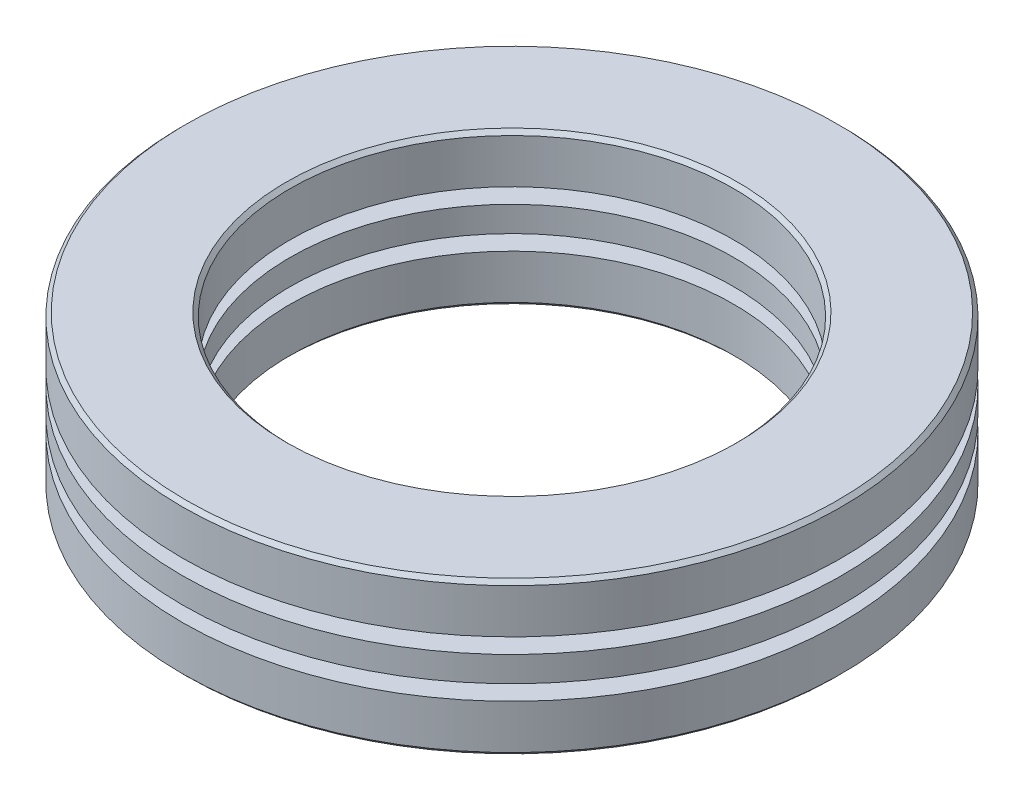
ISO-10303-21;
HEADER;
FILE_DESCRIPTION(('STEP AP214'),'2;1');
FILE_NAME('part.step','',(''),(''),'','','');
FILE_SCHEMA(('AUTOMOTIVE_DESIGN { 1 0 10303 214 1 1 1 1 }'));
ENDSEC;
DATA;
#1=APPLICATION_CONTEXT('core data for automotive mechanical design processes');
#2=APPLICATION_PROTOCOL_DEFINITION('international standard','automotive_design',2000,#1);
#3=PRODUCT_CONTEXT('',#1,'mechanical');
#4=PRODUCT('Part','Part','',(#3));
#5=PRODUCT_RELATED_PRODUCT_CATEGORY('part','',(#4));
#6=PRODUCT_DEFINITION_FORMATION('','',#4);
#7=PRODUCT_DEFINITION_CONTEXT('part definition',#1,'design');
#8=PRODUCT_DEFINITION('design','',#6,#7);
#9=PRODUCT_DEFINITION_SHAPE('','',#8);
#10=(LENGTH_UNIT() NAMED_UNIT(*) SI_UNIT(.MILLI.,.METRE.));
#11=(NAMED_UNIT(*) PLANE_ANGLE_UNIT() SI_UNIT($,.RADIAN.));
#12=(NAMED_UNIT(*) SI_UNIT($,.STERADIAN.) SOLID_ANGLE_UNIT());
#13=UNCERTAINTY_MEASURE_WITH_UNIT(LENGTH_MEASURE(1.E-05),#10,'distance_accuracy_value','');
#14=(GEOMETRIC_REPRESENTATION_CONTEXT(3) GLOBAL_UNCERTAINTY_ASSIGNED_CONTEXT((#13)) GLOBAL_UNIT_ASSIGNED_CONTEXT((#10,
#11,#12)) REPRESENTATION_CONTEXT('',''));
#15=CARTESIAN_POINT('',(0.,0.,0.));
#16=DIRECTION('',(0.,0.,1.));
#17=DIRECTION('',(1.,0.,0.));
#18=AXIS2_PLACEMENT_3D('',#15,#16,#17);
#19=CARTESIAN_POINT('',(-20.0943798321206,6.,8.32336465394043));
#20=DIRECTION('',(-0.923879532511292,0.,0.382683432365077));
#21=DIRECTION('',(0.,1.,0.));
#22=AXIS2_PLACEMENT_3D('',#19,#20,#21);
#23=SPHERICAL_SURFACE('',#22,2.2);
#24=CARTESIAN_POINT('',(-22.1269148036454,6.,9.1652682051436));
#25=VERTEX_POINT('',#24);
#26=VERTEX_LOOP('',#25);
#27=FACE_BOUND('',#26,.T.);
#28=ADVANCED_FACE('F37',(#27),#23,.T.);
#29=CLOSED_SHELL('',(#28));
#30=MANIFOLD_SOLID_BREP('B2',#29);
#31=CARTESIAN_POINT('',(-15.3795724908076,6.,15.3795724908072));
#32=DIRECTION('',(-0.707106781186556,0.,0.707106781186539));
#33=DIRECTION('',(0.,1.,0.));
#34=AXIS2_PLACEMENT_3D('',#31,#32,#33);
#35=SPHERICAL_SURFACE('',#34,2.2);
#36=CARTESIAN_POINT('',(-16.935207409418,6.,16.9352074094176));
#37=VERTEX_POINT('',#36);
#38=VERTEX_LOOP('',#37);
#39=FACE_BOUND('',#38,.T.);
#40=ADVANCED_FACE('F55',(#39),#35,.T.);
#41=CLOSED_SHELL('',(#40));
#42=MANIFOLD_SOLID_BREP('B6',#41);
#43=CARTESIAN_POINT('',(-8.32336465394092,6.,20.0943798321204));
#44=DIRECTION('',(-0.3826834323651,0.,0.923879532511283));
#45=DIRECTION('',(0.,1.,0.));
#46=AXIS2_PLACEMENT_3D('',#43,#44,#45);
#47=SPHERICAL_SURFACE('',#46,2.2);
#48=CARTESIAN_POINT('',(-9.16526820514414,6.,22.1269148036452));
#49=VERTEX_POINT('',#48);
#50=VERTEX_LOOP('',#49);
#51=FACE_BOUND('',#50,.T.);
#52=ADVANCED_FACE('F73',(#51),#47,.T.);
#53=CLOSED_SHELL('',(#52));
#54=MANIFOLD_SOLID_BREP('B33',#53);
#55=CARTESIAN_POINT('',(-2.27819157359514E-13,6.,21.75));
#56=DIRECTION('',(0.,0.,1.));
#57=DIRECTION('',(0.,1.,0.));
#58=AXIS2_PLACEMENT_3D('',#55,#56,#57);
#59=SPHERICAL_SURFACE('',#58,2.2);
#60=CARTESIAN_POINT('',(-2.50862934195879E-13,6.,23.95));
#61=VERTEX_POINT('',#60);
#62=VERTEX_LOOP('',#61);
#63=FACE_BOUND('',#62,.T.);
#64=ADVANCED_FACE('F91',(#63),#59,.T.);
#65=CLOSED_SHELL('',(#64));
#66=MANIFOLD_SOLID_BREP('B51',#65);
#67=CARTESIAN_POINT('',(8.3233646539405,6.,20.0943798321206));
#68=DIRECTION('',(0.382683432365081,0.,0.923879532511291));
#69=DIRECTION('',(0.,1.,0.));
#70=AXIS2_PLACEMENT_3D('',#67,#68,#69);
#71=SPHERICAL_SURFACE('',#70,2.2);
#72=CARTESIAN_POINT('',(9.16526820514368,6.,22.1269148036454));
#73=VERTEX_POINT('',#72);
#74=VERTEX_LOOP('',#73);
#75=FACE_BOUND('',#74,.T.);
#76=ADVANCED_FACE('F109',(#75),#71,.T.);
#77=CLOSED_SHELL('',(#76));
#78=MANIFOLD_SOLID_BREP('B69',#77);
#79=CARTESIAN_POINT('',(15.3795724908073,6.,15.3795724908075));
#80=DIRECTION('',(0.707106781186541,0.,0.707106781186554));
#81=DIRECTION('',(0.,1.,0.));
#82=AXIS2_PLACEMENT_3D('',#79,#80,#81);
#83=SPHERICAL_SURFACE('',#82,2.2);
#84=CARTESIAN_POINT('',(16.9352074094177,6.,16.935207409418));
#85=VERTEX_POINT('',#84);
#86=VERTEX_LOOP('',#85);
#87=FACE_BOUND('',#86,.T.);
#88=ADVANCED_FACE('F127',(#87),#83,.T.);
#89=CLOSED_SHELL('',(#88));
#90=MANIFOLD_SOLID_BREP('B87',#89);
#91=CARTESIAN_POINT('',(20.0943798321204,6.,8.32336465394086));
#92=DIRECTION('',(0.923879532511284,0.,0.382683432365097));
#93=DIRECTION('',(0.,1.,0.));
#94=AXIS2_PLACEMENT_3D('',#91,#92,#93);
#95=SPHERICAL_SURFACE('',#94,2.2);
#96=CARTESIAN_POINT('',(22.1269148036452,6.,9.16526820514407));
#97=VERTEX_POINT('',#96);
#98=VERTEX_LOOP('',#97);
#99=FACE_BOUND('',#98,.T.);
#100=ADVANCED_FACE('F145',(#99),#95,.T.);
#101=CLOSED_SHELL('',(#100));
#102=MANIFOLD_SOLID_BREP('B105',#101);
#103=CARTESIAN_POINT('',(21.75,6.,0.));
#104=DIRECTION('',(1.,0.,0.));
#105=DIRECTION('',(0.,1.,0.));
#106=AXIS2_PLACEMENT_3D('',#103,#104,#105);
#107=SPHERICAL_SURFACE('',#106,2.2);
#108=CARTESIAN_POINT('',(23.95,6.,0.));
#109=VERTEX_POINT('',#108);
#110=VERTEX_LOOP('',#109);
#111=FACE_BOUND('',#110,.T.);
#112=ADVANCED_FACE('F163',(#111),#107,.T.);
#113=CLOSED_SHELL('',(#112));
#114=MANIFOLD_SOLID_BREP('B123',#113);
#115=CARTESIAN_POINT('',(20.0943798321205,6.,-8.32336465394058));
#116=DIRECTION('',(0.923879532511289,0.,-0.382683432365084));
#117=DIRECTION('',(0.,1.,0.));
#118=AXIS2_PLACEMENT_3D('',#115,#116,#117);
#119=SPHERICAL_SURFACE('',#118,2.2);
#120=CARTESIAN_POINT('',(22.1269148036454,6.,-9.16526820514376));
#121=VERTEX_POINT('',#120);
#122=VERTEX_LOOP('',#121);
#123=FACE_BOUND('',#122,.T.);
#124=ADVANCED_FACE('F181',(#123),#119,.T.);
#125=CLOSED_SHELL('',(#124));
#126=MANIFOLD_SOLID_BREP('B141',#125);
#127=CARTESIAN_POINT('',(15.3795724908075,6.,-15.3795724908073));
#128=DIRECTION('',(0.707106781186551,0.,-0.707106781186544));
#129=DIRECTION('',(0.,1.,0.));
#130=AXIS2_PLACEMENT_3D('',#127,#128,#129);
#131=SPHERICAL_SURFACE('',#130,2.2);
#132=CARTESIAN_POINT('',(16.9352074094179,6.,-16.9352074094177));
#133=VERTEX_POINT('',#132);
#134=VERTEX_LOOP('',#133);
#135=FACE_BOUND('',#134,.T.);
#136=ADVANCED_FACE('F199',(#135),#131,.T.);
#137=CLOSED_SHELL('',(#136));
#138=MANIFOLD_SOLID_BREP('B159',#137);
#139=CARTESIAN_POINT('',(8.32336465394079,6.,-20.0943798321205));
#140=DIRECTION('',(0.382683432365094,0.,-0.923879532511285));
#141=DIRECTION('',(0.,1.,0.));
#142=AXIS2_PLACEMENT_3D('',#139,#140,#141);
#143=SPHERICAL_SURFACE('',#142,2.2);
#144=CARTESIAN_POINT('',(9.165268205144,6.,-22.1269148036453));
#145=VERTEX_POINT('',#144);
#146=VERTEX_LOOP('',#145);
#147=FACE_BOUND('',#146,.T.);
#148=ADVANCED_FACE('F217',(#147),#143,.T.);
#149=CLOSED_SHELL('',(#148));
#150=MANIFOLD_SOLID_BREP('B177',#149);
#151=CARTESIAN_POINT('',(0.,6.,-21.75));
#152=DIRECTION('',(0.,0.,-1.));
#153=DIRECTION('',(0.,1.,0.));
#154=AXIS2_PLACEMENT_3D('',#151,#152,#153);
#155=SPHERICAL_SURFACE('',#154,2.2);
#156=CARTESIAN_POINT('',(0.,6.,-23.95));
#157=VERTEX_POINT('',#156);
#158=VERTEX_LOOP('',#157);
#159=FACE_BOUND('',#158,.T.);
#160=ADVANCED_FACE('F235',(#159),#155,.T.);
#161=CLOSED_SHELL('',(#160));
#162=MANIFOLD_SOLID_BREP('B195',#161);
#163=CARTESIAN_POINT('',(-8.32336465394065,6.,-20.0943798321205));
#164=DIRECTION('',(-0.382683432365087,0.,-0.923879532511288));
#165=DIRECTION('',(0.,1.,0.));
#166=AXIS2_PLACEMENT_3D('',#163,#164,#165);
#167=SPHERICAL_SURFACE('',#166,2.2);
#168=CARTESIAN_POINT('',(-9.16526820514384,6.,-22.1269148036453));
#169=VERTEX_POINT('',#168);
#170=VERTEX_LOOP('',#169);
#171=FACE_BOUND('',#170,.T.);
#172=ADVANCED_FACE('F253',(#171),#167,.T.);
#173=CLOSED_SHELL('',(#172));
#174=MANIFOLD_SOLID_BREP('B213',#173);
#175=CARTESIAN_POINT('',(-15.3795724908074,6.,-15.3795724908074));
#176=DIRECTION('',(-0.707106781186546,0.,-0.707106781186549));
#177=DIRECTION('',(0.,1.,0.));
#178=AXIS2_PLACEMENT_3D('',#175,#176,#177);
#179=SPHERICAL_SURFACE('',#178,2.2);
#180=CARTESIAN_POINT('',(-16.9352074094178,6.,-16.9352074094178));
#181=VERTEX_POINT('',#180);
#182=VERTEX_LOOP('',#181);
#183=FACE_BOUND('',#182,.T.);
#184=ADVANCED_FACE('F271',(#183),#179,.T.);
#185=CLOSED_SHELL('',(#184));
#186=MANIFOLD_SOLID_BREP('B231',#185);
#187=CARTESIAN_POINT('',(-20.0943798321205,6.,-8.32336465394072));
#188=DIRECTION('',(-0.923879532511287,0.,-0.382683432365091));
#189=DIRECTION('',(0.,1.,0.));
#190=AXIS2_PLACEMENT_3D('',#187,#188,#189);
#191=SPHERICAL_SURFACE('',#190,2.2);
#192=CARTESIAN_POINT('',(-22.1269148036453,6.,-9.16526820514392));
#193=VERTEX_POINT('',#192);
#194=VERTEX_LOOP('',#193);
#195=FACE_BOUND('',#194,.T.);
#196=ADVANCED_FACE('F289',(#195),#191,.T.);
#197=CLOSED_SHELL('',(#196));
#198=MANIFOLD_SOLID_BREP('B249',#197);
#199=CARTESIAN_POINT('',(-21.75,6.,0.));
#200=DIRECTION('',(-1.,0.,0.));
#201=DIRECTION('',(0.,1.,0.));
#202=AXIS2_PLACEMENT_3D('',#199,#200,#201);
#203=SPHERICAL_SURFACE('',#202,2.2);
#204=CARTESIAN_POINT('',(-23.95,6.,0.));
#205=VERTEX_POINT('',#204);
#206=VERTEX_LOOP('',#205);
#207=FACE_BOUND('',#206,.T.);
#208=ADVANCED_FACE('F309',(#207),#203,.T.);
#209=CLOSED_SHELL('',(#208));
#210=MANIFOLD_SOLID_BREP('B267',#209);
#211=CARTESIAN_POINT('',(0.,12.,0.));
#212=DIRECTION('',(0.,1.,0.));
#213=DIRECTION('',(0.,0.,1.));
#214=AXIS2_PLACEMENT_3D('',#211,#212,#213);
#215=PLANE('',#214);
#216=CARTESIAN_POINT('',(0.,12.,0.));
#217=DIRECTION('',(0.,1.,0.));
#218=DIRECTION('',(0.,0.,1.));
#219=AXIS2_PLACEMENT_3D('',#216,#217,#218);
#220=CIRCLE('',#219,17.8);
#221=CARTESIAN_POINT('',(0.,12.,17.8));
#222=VERTEX_POINT('',#221);
#223=EDGE_CURVE('E337',#222,#222,#220,.F.);
#224=ORIENTED_EDGE('',*,*,#223,.T.);
#225=EDGE_LOOP('',(#224));
#226=FACE_BOUND('',#225,.T.);
#227=CARTESIAN_POINT('',(0.,12.,0.));
#228=DIRECTION('',(0.,1.,0.));
#229=DIRECTION('',(0.,0.,1.));
#230=AXIS2_PLACEMENT_3D('',#227,#228,#229);
#231=CIRCLE('',#230,25.7);
#232=CARTESIAN_POINT('',(0.,12.,25.7));
#233=VERTEX_POINT('',#232);
#234=EDGE_CURVE('E341',#233,#233,#231,.T.);
#235=ORIENTED_EDGE('',*,*,#234,.T.);
#236=EDGE_LOOP('',(#235));
#237=FACE_BOUND('',#236,.T.);
#238=ADVANCED_FACE('F329',(#226,#237),#215,.T.);
#239=CARTESIAN_POINT('',(0.,8.2,0.));
#240=DIRECTION('',(0.,1.,0.));
#241=DIRECTION('',(0.,0.,1.));
#242=AXIS2_PLACEMENT_3D('',#239,#240,#241);
#243=PLANE('',#242);
#244=CARTESIAN_POINT('',(0.,8.2,0.));
#245=DIRECTION('',(0.,1.,0.));
#246=DIRECTION('',(0.,0.,1.));
#247=AXIS2_PLACEMENT_3D('',#244,#245,#246);
#248=CIRCLE('',#247,26.);
#249=CARTESIAN_POINT('',(0.,8.2,26.));
#250=VERTEX_POINT('',#249);
#251=EDGE_CURVE('E350',#250,#250,#248,.T.);
#252=ORIENTED_EDGE('',*,*,#251,.F.);
#253=EDGE_LOOP('',(#252));
#254=FACE_BOUND('',#253,.T.);
#255=CARTESIAN_POINT('',(0.,8.2,0.));
#256=DIRECTION('',(0.,1.,0.));
#257=DIRECTION('',(0.,0.,1.));
#258=AXIS2_PLACEMENT_3D('',#255,#256,#257);
#259=CIRCLE('',#258,17.5);
#260=CARTESIAN_POINT('',(0.,8.2,17.5));
#261=VERTEX_POINT('',#260);
#262=EDGE_CURVE('E353',#261,#261,#259,.T.);
#263=ORIENTED_EDGE('',*,*,#262,.T.);
#264=EDGE_LOOP('',(#263));
#265=FACE_BOUND('',#264,.T.);
#266=ADVANCED_FACE('F357',(#254,#265),#243,.F.);
#267=CARTESIAN_POINT('',(0.,12.,0.));
#268=DIRECTION('',(0.,-1.,0.));
#269=DIRECTION('',(0.,0.,-1.));
#270=AXIS2_PLACEMENT_3D('',#267,#268,#269);
#271=CYLINDRICAL_SURFACE('',#270,26.);
#272=CARTESIAN_POINT('',(0.,11.7,0.));
#273=DIRECTION('',(0.,1.,0.));
#274=DIRECTION('',(0.,0.,1.));
#275=AXIS2_PLACEMENT_3D('',#272,#273,#274);
#276=CIRCLE('',#275,26.);
#277=CARTESIAN_POINT('',(0.,11.7,26.));
#278=VERTEX_POINT('',#277);
#279=EDGE_CURVE('E308',#278,#278,#276,.F.);
#280=ORIENTED_EDGE('',*,*,#279,.T.);
#281=EDGE_LOOP('',(#280));
#282=FACE_BOUND('',#281,.T.);
#283=ORIENTED_EDGE('',*,*,#251,.T.);
#284=EDGE_LOOP('',(#283));
#285=FACE_BOUND('',#284,.T.);
#286=ADVANCED_FACE('F362',(#282,#285),#271,.T.);
#287=CARTESIAN_POINT('',(0.,12.,0.));
#288=DIRECTION('',(0.,-1.,0.));
#289=DIRECTION('',(0.,0.,-1.));
#290=AXIS2_PLACEMENT_3D('',#287,#288,#289);
#291=CYLINDRICAL_SURFACE('',#290,17.5);
#292=CARTESIAN_POINT('',(0.,11.7,0.));
#293=DIRECTION('',(0.,1.,0.));
#294=DIRECTION('',(0.,0.,1.));
#295=AXIS2_PLACEMENT_3D('',#292,#293,#294);
#296=CIRCLE('',#295,17.5);
#297=CARTESIAN_POINT('',(0.,11.7,17.5));
#298=VERTEX_POINT('',#297);
#299=EDGE_CURVE('E345',#298,#298,#296,.T.);
#300=ORIENTED_EDGE('',*,*,#299,.T.);
#301=EDGE_LOOP('',(#300));
#302=FACE_BOUND('',#301,.T.);
#303=ORIENTED_EDGE('',*,*,#262,.F.);
#304=EDGE_LOOP('',(#303));
#305=FACE_BOUND('',#304,.T.);
#306=ADVANCED_FACE('F359',(#302,#305),#291,.F.);
#307=CARTESIAN_POINT('',(0.,11.7,0.));
#308=DIRECTION('',(0.,1.,0.));
#309=DIRECTION('',(0.,0.,1.));
#310=AXIS2_PLACEMENT_3D('',#307,#308,#309);
#311=CONICAL_SURFACE('',#310,17.5,0.785398163397443);
#312=ORIENTED_EDGE('',*,*,#223,.F.);
#313=EDGE_LOOP('',(#312));
#314=FACE_BOUND('',#313,.T.);
#315=ORIENTED_EDGE('',*,*,#299,.F.);
#316=EDGE_LOOP('',(#315));
#317=FACE_BOUND('',#316,.T.);
#318=ADVANCED_FACE('F361',(#314,#317),#311,.F.);
#319=CARTESIAN_POINT('',(0.,12.,0.));
#320=DIRECTION('',(0.,-1.,0.));
#321=DIRECTION('',(0.,0.,-1.));
#322=AXIS2_PLACEMENT_3D('',#319,#320,#321);
#323=CONICAL_SURFACE('',#322,25.7,0.785398163397437);
#324=ORIENTED_EDGE('',*,*,#279,.F.);
#325=EDGE_LOOP('',(#324));
#326=FACE_BOUND('',#325,.T.);
#327=ORIENTED_EDGE('',*,*,#234,.F.);
#328=EDGE_LOOP('',(#327));
#329=FACE_BOUND('',#328,.T.);
#330=ADVANCED_FACE('F332',(#326,#329),#323,.T.);
#331=CLOSED_SHELL('',(#238,#266,#286,#306,#318,#330));
#332=MANIFOLD_SOLID_BREP('B285',#331);
#333=CARTESIAN_POINT('',(0.,7.,0.));
#334=DIRECTION('',(0.,1.,0.));
#335=DIRECTION('',(0.,0.,1.));
#336=AXIS2_PLACEMENT_3D('',#333,#334,#335);
#337=PLANE('',#336);
#338=CARTESIAN_POINT('',(-20.0943798321206,7.,-8.32336465394043));
#339=DIRECTION('',(0.,1.,0.));
#340=DIRECTION('',(0.,0.,1.));
#341=AXIS2_PLACEMENT_3D('',#338,#339,#340);
#342=CIRCLE('',#341,1.95959179422654);
#343=CARTESIAN_POINT('',(-20.0943798321206,7.,-6.36377285971389));
#344=VERTEX_POINT('',#343);
#345=EDGE_CURVE('E510',#344,#344,#342,.F.);
#346=ORIENTED_EDGE('',*,*,#345,.T.);
#347=EDGE_LOOP('',(#346));
#348=FACE_BOUND('',#347,.T.);
#349=CARTESIAN_POINT('',(-15.3795724908076,7.,-15.3795724908072));
#350=DIRECTION('',(0.,1.,0.));
#351=DIRECTION('',(0.,0.,1.));
#352=AXIS2_PLACEMENT_3D('',#349,#350,#351);
#353=CIRCLE('',#352,1.95959179422654);
#354=CARTESIAN_POINT('',(-15.3795724908076,7.,-13.4199806965807));
#355=VERTEX_POINT('',#354);
#356=EDGE_CURVE('E507',#355,#355,#353,.F.);
#357=ORIENTED_EDGE('',*,*,#356,.T.);
#358=EDGE_LOOP('',(#357));
#359=FACE_BOUND('',#358,.T.);
#360=CARTESIAN_POINT('',(-8.32336465394092,7.,-20.0943798321204));
#361=DIRECTION('',(0.,1.,0.));
#362=DIRECTION('',(0.,0.,1.));
#363=AXIS2_PLACEMENT_3D('',#360,#361,#362);
#364=CIRCLE('',#363,1.95959179422654);
#365=CARTESIAN_POINT('',(-8.32336465394092,7.,-18.1347880378939));
#366=VERTEX_POINT('',#365);
#367=EDGE_CURVE('E504',#366,#366,#364,.F.);
#368=ORIENTED_EDGE('',*,*,#367,.T.);
#369=EDGE_LOOP('',(#368));
#370=FACE_BOUND('',#369,.T.);
#371=CARTESIAN_POINT('',(-2.27819157359514E-13,7.,-21.75));
#372=DIRECTION('',(0.,1.,0.));
#373=DIRECTION('',(0.,0.,1.));
#374=AXIS2_PLACEMENT_3D('',#371,#372,#373);
#375=CIRCLE('',#374,1.95959179422654);
#376=CARTESIAN_POINT('',(-2.27819157359514E-13,7.,-19.7904082057735));
#377=VERTEX_POINT('',#376);
#378=EDGE_CURVE('E500',#377,#377,#375,.F.);
#379=ORIENTED_EDGE('',*,*,#378,.T.);
#380=EDGE_LOOP('',(#379));
#381=FACE_BOUND('',#380,.T.);
#382=CARTESIAN_POINT('',(8.3233646539405,7.,-20.0943798321206));
#383=DIRECTION('',(0.,1.,0.));
#384=DIRECTION('',(0.,0.,1.));
#385=AXIS2_PLACEMENT_3D('',#382,#383,#384);
#386=CIRCLE('',#385,1.95959179422654);
#387=CARTESIAN_POINT('',(8.3233646539405,7.,-18.134788037894));
#388=VERTEX_POINT('',#387);
#389=EDGE_CURVE('E496',#388,#388,#386,.F.);
#390=ORIENTED_EDGE('',*,*,#389,.T.);
#391=EDGE_LOOP('',(#390));
#392=FACE_BOUND('',#391,.T.);
#393=CARTESIAN_POINT('',(15.3795724908073,7.,-15.3795724908075));
#394=DIRECTION('',(0.,1.,0.));
#395=DIRECTION('',(0.,0.,1.));
#396=AXIS2_PLACEMENT_3D('',#393,#394,#395);
#397=CIRCLE('',#396,1.95959179422654);
#398=CARTESIAN_POINT('',(15.3795724908073,7.,-13.419980696581));
#399=VERTEX_POINT('',#398);
#400=EDGE_CURVE('E492',#399,#399,#397,.F.);
#401=ORIENTED_EDGE('',*,*,#400,.T.);
#402=EDGE_LOOP('',(#401));
#403=FACE_BOUND('',#402,.T.);
#404=CARTESIAN_POINT('',(20.0943798321204,7.,-8.32336465394086));
#405=DIRECTION('',(0.,1.,0.));
#406=DIRECTION('',(0.,0.,1.));
#407=AXIS2_PLACEMENT_3D('',#404,#405,#406);
#408=CIRCLE('',#407,1.95959179422654);
#409=CARTESIAN_POINT('',(20.0943798321204,7.,-6.36377285971432));
#410=VERTEX_POINT('',#409);
#411=EDGE_CURVE('E488',#410,#410,#408,.F.);
#412=ORIENTED_EDGE('',*,*,#411,.T.);
#413=EDGE_LOOP('',(#412));
#414=FACE_BOUND('',#413,.T.);
#415=CARTESIAN_POINT('',(21.75,7.,0.));
#416=DIRECTION('',(0.,1.,0.));
#417=DIRECTION('',(0.,0.,1.));
#418=AXIS2_PLACEMENT_3D('',#415,#416,#417);
#419=CIRCLE('',#418,1.95959179422654);
#420=CARTESIAN_POINT('',(21.75,7.,1.95959179422654));
#421=VERTEX_POINT('',#420);
#422=EDGE_CURVE('E484',#421,#421,#419,.F.);
#423=ORIENTED_EDGE('',*,*,#422,.T.);
#424=EDGE_LOOP('',(#423));
#425=FACE_BOUND('',#424,.T.);
#426=CARTESIAN_POINT('',(20.0943798321205,7.,8.32336465394058));
#427=DIRECTION('',(0.,1.,0.));
#428=DIRECTION('',(0.,0.,1.));
#429=AXIS2_PLACEMENT_3D('',#426,#427,#428);
#430=CIRCLE('',#429,1.95959179422654);
#431=CARTESIAN_POINT('',(20.0943798321205,7.,10.2829564481671));
#432=VERTEX_POINT('',#431);
#433=EDGE_CURVE('E480',#432,#432,#430,.F.);
#434=ORIENTED_EDGE('',*,*,#433,.T.);
#435=EDGE_LOOP('',(#434));
#436=FACE_BOUND('',#435,.T.);
#437=CARTESIAN_POINT('',(15.3795724908075,7.,15.3795724908073));
#438=DIRECTION('',(0.,1.,0.));
#439=DIRECTION('',(0.,0.,1.));
#440=AXIS2_PLACEMENT_3D('',#437,#438,#439);
#441=CIRCLE('',#440,1.95959179422654);
#442=CARTESIAN_POINT('',(15.3795724908075,7.,17.3391642850339));
#443=VERTEX_POINT('',#442);
#444=EDGE_CURVE('E476',#443,#443,#441,.F.);
#445=ORIENTED_EDGE('',*,*,#444,.T.);
#446=EDGE_LOOP('',(#445));
#447=FACE_BOUND('',#446,.T.);
#448=CARTESIAN_POINT('',(8.32336465394079,7.,20.0943798321205));
#449=DIRECTION('',(0.,1.,0.));
#450=DIRECTION('',(0.,0.,1.));
#451=AXIS2_PLACEMENT_3D('',#448,#449,#450);
#452=CIRCLE('',#451,1.95959179422654);
#453=CARTESIAN_POINT('',(8.32336465394079,7.,22.053971626347));
#454=VERTEX_POINT('',#453);
#455=EDGE_CURVE('E472',#454,#454,#452,.F.);
#456=ORIENTED_EDGE('',*,*,#455,.T.);
#457=EDGE_LOOP('',(#456));
#458=FACE_BOUND('',#457,.T.);
#459=CARTESIAN_POINT('',(0.,7.,21.75));
#460=DIRECTION('',(0.,1.,0.));
#461=DIRECTION('',(0.,0.,1.));
#462=AXIS2_PLACEMENT_3D('',#459,#460,#461);
#463=CIRCLE('',#462,1.95959179422654);
#464=CARTESIAN_POINT('',(0.,7.,23.7095917942265));
#465=VERTEX_POINT('',#464);
#466=EDGE_CURVE('E468',#465,#465,#463,.F.);
#467=ORIENTED_EDGE('',*,*,#466,.T.);
#468=EDGE_LOOP('',(#467));
#469=FACE_BOUND('',#468,.T.);
#470=CARTESIAN_POINT('',(-8.32336465394065,7.,20.0943798321205));
#471=DIRECTION('',(0.,1.,0.));
#472=DIRECTION('',(0.,0.,1.));
#473=AXIS2_PLACEMENT_3D('',#470,#471,#472);
#474=CIRCLE('',#473,1.95959179422654);
#475=CARTESIAN_POINT('',(-8.32336465394065,7.,22.053971626347));
#476=VERTEX_POINT('',#475);
#477=EDGE_CURVE('E464',#476,#476,#474,.F.);
#478=ORIENTED_EDGE('',*,*,#477,.T.);
#479=EDGE_LOOP('',(#478));
#480=FACE_BOUND('',#479,.T.);
#481=CARTESIAN_POINT('',(-15.3795724908074,7.,15.3795724908074));
#482=DIRECTION('',(0.,1.,0.));
#483=DIRECTION('',(0.,0.,1.));
#484=AXIS2_PLACEMENT_3D('',#481,#482,#483);
#485=CIRCLE('',#484,1.95959179422654);
#486=CARTESIAN_POINT('',(-15.3795724908074,7.,17.339164285034));
#487=VERTEX_POINT('',#486);
#488=EDGE_CURVE('E460',#487,#487,#485,.F.);
#489=ORIENTED_EDGE('',*,*,#488,.T.);
#490=EDGE_LOOP('',(#489));
#491=FACE_BOUND('',#490,.T.);
#492=CARTESIAN_POINT('',(-20.0943798321205,7.,8.32336465394072));
#493=DIRECTION('',(0.,1.,0.));
#494=DIRECTION('',(0.,0.,1.));
#495=AXIS2_PLACEMENT_3D('',#492,#493,#494);
#496=CIRCLE('',#495,1.95959179422654);
#497=CARTESIAN_POINT('',(-20.0943798321205,7.,10.2829564481673));
#498=VERTEX_POINT('',#497);
#499=EDGE_CURVE('E456',#498,#498,#496,.F.);
#500=ORIENTED_EDGE('',*,*,#499,.T.);
#501=EDGE_LOOP('',(#500));
#502=FACE_BOUND('',#501,.T.);
#503=CARTESIAN_POINT('',(-21.75,7.,0.));
#504=DIRECTION('',(0.,1.,0.));
#505=DIRECTION('',(0.,0.,1.));
#506=AXIS2_PLACEMENT_3D('',#503,#504,#505);
#507=CIRCLE('',#506,1.95959179422654);
#508=CARTESIAN_POINT('',(-21.75,7.,1.95959179422654));
#509=VERTEX_POINT('',#508);
#510=EDGE_CURVE('E455',#509,#509,#507,.F.);
#511=ORIENTED_EDGE('',*,*,#510,.T.);
#512=EDGE_LOOP('',(#511));
#513=FACE_BOUND('',#512,.T.);
#514=CARTESIAN_POINT('',(0.,7.,0.));
#515=DIRECTION('',(0.,1.,0.));
#516=DIRECTION('',(0.,0.,1.));
#517=AXIS2_PLACEMENT_3D('',#514,#515,#516);
#518=CIRCLE('',#517,26.);
#519=CARTESIAN_POINT('',(0.,7.,26.));
#520=VERTEX_POINT('',#519);
#521=EDGE_CURVE('E328',#520,#520,#518,.T.);
#522=ORIENTED_EDGE('',*,*,#521,.T.);
#523=EDGE_LOOP('',(#522));
#524=FACE_BOUND('',#523,.T.);
#525=CARTESIAN_POINT('',(0.,7.,0.));
#526=DIRECTION('',(0.,1.,0.));
#527=DIRECTION('',(0.,0.,1.));
#528=AXIS2_PLACEMENT_3D('',#525,#526,#527);
#529=CIRCLE('',#528,17.5);
#530=CARTESIAN_POINT('',(0.,7.,17.5));
#531=VERTEX_POINT('',#530);
#532=EDGE_CURVE('E446',#531,#531,#529,.T.);
#533=ORIENTED_EDGE('',*,*,#532,.F.);
#534=EDGE_LOOP('',(#533));
#535=FACE_BOUND('',#534,.T.);
#536=ADVANCED_FACE('F433',(#348,#359,#370,#381,#392,#403,#414,#425,#436,#447,#458,#469,#480,
#491,#502,#513,#524,#535),#337,.T.);
#537=CARTESIAN_POINT('',(0.,5.,0.));
#538=DIRECTION('',(0.,1.,0.));
#539=DIRECTION('',(0.,0.,1.));
#540=AXIS2_PLACEMENT_3D('',#537,#538,#539);
#541=PLANE('',#540);
#542=CARTESIAN_POINT('',(-20.0943798321206,5.,-8.32336465394043));
#543=DIRECTION('',(0.,1.,0.));
#544=DIRECTION('',(0.,0.,1.));
#545=AXIS2_PLACEMENT_3D('',#542,#543,#544);
#546=CIRCLE('',#545,1.95959179422654);
#547=CARTESIAN_POINT('',(-20.0943798321206,5.,-6.36377285971389));
#548=VERTEX_POINT('',#547);
#549=EDGE_CURVE('E437',#548,#548,#546,.F.);
#550=ORIENTED_EDGE('',*,*,#549,.F.);
#551=EDGE_LOOP('',(#550));
#552=FACE_BOUND('',#551,.T.);
#553=CARTESIAN_POINT('',(-15.3795724908076,5.,-15.3795724908072));
#554=DIRECTION('',(0.,1.,0.));
#555=DIRECTION('',(0.,0.,1.));
#556=AXIS2_PLACEMENT_3D('',#553,#554,#555);
#557=CIRCLE('',#556,1.95959179422654);
#558=CARTESIAN_POINT('',(-15.3795724908076,5.,-13.4199806965807));
#559=VERTEX_POINT('',#558);
#560=EDGE_CURVE('E508',#559,#559,#557,.F.);
#561=ORIENTED_EDGE('',*,*,#560,.F.);
#562=EDGE_LOOP('',(#561));
#563=FACE_BOUND('',#562,.T.);
#564=CARTESIAN_POINT('',(-8.32336465394092,5.,-20.0943798321204));
#565=DIRECTION('',(0.,1.,0.));
#566=DIRECTION('',(0.,0.,1.));
#567=AXIS2_PLACEMENT_3D('',#564,#565,#566);
#568=CIRCLE('',#567,1.95959179422654);
#569=CARTESIAN_POINT('',(-8.32336465394092,5.,-18.1347880378939));
#570=VERTEX_POINT('',#569);
#571=EDGE_CURVE('E505',#570,#570,#568,.F.);
#572=ORIENTED_EDGE('',*,*,#571,.F.);
#573=EDGE_LOOP('',(#572));
#574=FACE_BOUND('',#573,.T.);
#575=CARTESIAN_POINT('',(-2.27819157359514E-13,5.,-21.75));
#576=DIRECTION('',(0.,1.,0.));
#577=DIRECTION('',(0.,0.,1.));
#578=AXIS2_PLACEMENT_3D('',#575,#576,#577);
#579=CIRCLE('',#578,1.95959179422654);
#580=CARTESIAN_POINT('',(-2.27819157359514E-13,5.,-19.7904082057735));
#581=VERTEX_POINT('',#580);
#582=EDGE_CURVE('E501',#581,#581,#579,.F.);
#583=ORIENTED_EDGE('',*,*,#582,.F.);
#584=EDGE_LOOP('',(#583));
#585=FACE_BOUND('',#584,.T.);
#586=CARTESIAN_POINT('',(8.3233646539405,5.,-20.0943798321206));
#587=DIRECTION('',(0.,1.,0.));
#588=DIRECTION('',(0.,0.,1.));
#589=AXIS2_PLACEMENT_3D('',#586,#587,#588);
#590=CIRCLE('',#589,1.95959179422654);
#591=CARTESIAN_POINT('',(8.3233646539405,5.,-18.134788037894));
#592=VERTEX_POINT('',#591);
#593=EDGE_CURVE('E497',#592,#592,#590,.F.);
#594=ORIENTED_EDGE('',*,*,#593,.F.);
#595=EDGE_LOOP('',(#594));
#596=FACE_BOUND('',#595,.T.);
#597=CARTESIAN_POINT('',(15.3795724908073,5.,-15.3795724908075));
#598=DIRECTION('',(0.,1.,0.));
#599=DIRECTION('',(0.,0.,1.));
#600=AXIS2_PLACEMENT_3D('',#597,#598,#599);
#601=CIRCLE('',#600,1.95959179422654);
#602=CARTESIAN_POINT('',(15.3795724908073,5.,-13.419980696581));
#603=VERTEX_POINT('',#602);
#604=EDGE_CURVE('E493',#603,#603,#601,.F.);
#605=ORIENTED_EDGE('',*,*,#604,.F.);
#606=EDGE_LOOP('',(#605));
#607=FACE_BOUND('',#606,.T.);
#608=CARTESIAN_POINT('',(20.0943798321204,5.,-8.32336465394086));
#609=DIRECTION('',(0.,1.,0.));
#610=DIRECTION('',(0.,0.,1.));
#611=AXIS2_PLACEMENT_3D('',#608,#609,#610);
#612=CIRCLE('',#611,1.95959179422654);
#613=CARTESIAN_POINT('',(20.0943798321204,5.,-6.36377285971432));
#614=VERTEX_POINT('',#613);
#615=EDGE_CURVE('E489',#614,#614,#612,.F.);
#616=ORIENTED_EDGE('',*,*,#615,.F.);
#617=EDGE_LOOP('',(#616));
#618=FACE_BOUND('',#617,.T.);
#619=CARTESIAN_POINT('',(21.75,5.,0.));
#620=DIRECTION('',(0.,1.,0.));
#621=DIRECTION('',(0.,0.,1.));
#622=AXIS2_PLACEMENT_3D('',#619,#620,#621);
#623=CIRCLE('',#622,1.95959179422654);
#624=CARTESIAN_POINT('',(21.75,5.,1.95959179422654));
#625=VERTEX_POINT('',#624);
#626=EDGE_CURVE('E485',#625,#625,#623,.F.);
#627=ORIENTED_EDGE('',*,*,#626,.F.);
#628=EDGE_LOOP('',(#627));
#629=FACE_BOUND('',#628,.T.);
#630=CARTESIAN_POINT('',(20.0943798321205,5.,8.32336465394058));
#631=DIRECTION('',(0.,1.,0.));
#632=DIRECTION('',(0.,0.,1.));
#633=AXIS2_PLACEMENT_3D('',#630,#631,#632);
#634=CIRCLE('',#633,1.95959179422654);
#635=CARTESIAN_POINT('',(20.0943798321205,5.,10.2829564481671));
#636=VERTEX_POINT('',#635);
#637=EDGE_CURVE('E481',#636,#636,#634,.F.);
#638=ORIENTED_EDGE('',*,*,#637,.F.);
#639=EDGE_LOOP('',(#638));
#640=FACE_BOUND('',#639,.T.);
#641=CARTESIAN_POINT('',(15.3795724908075,5.,15.3795724908073));
#642=DIRECTION('',(0.,1.,0.));
#643=DIRECTION('',(0.,0.,1.));
#644=AXIS2_PLACEMENT_3D('',#641,#642,#643);
#645=CIRCLE('',#644,1.95959179422654);
#646=CARTESIAN_POINT('',(15.3795724908075,5.,17.3391642850339));
#647=VERTEX_POINT('',#646);
#648=EDGE_CURVE('E477',#647,#647,#645,.F.);
#649=ORIENTED_EDGE('',*,*,#648,.F.);
#650=EDGE_LOOP('',(#649));
#651=FACE_BOUND('',#650,.T.);
#652=CARTESIAN_POINT('',(8.32336465394079,5.,20.0943798321205));
#653=DIRECTION('',(0.,1.,0.));
#654=DIRECTION('',(0.,0.,1.));
#655=AXIS2_PLACEMENT_3D('',#652,#653,#654);
#656=CIRCLE('',#655,1.95959179422654);
#657=CARTESIAN_POINT('',(8.32336465394079,5.,22.053971626347));
#658=VERTEX_POINT('',#657);
#659=EDGE_CURVE('E473',#658,#658,#656,.F.);
#660=ORIENTED_EDGE('',*,*,#659,.F.);
#661=EDGE_LOOP('',(#660));
#662=FACE_BOUND('',#661,.T.);
#663=CARTESIAN_POINT('',(0.,5.,21.75));
#664=DIRECTION('',(0.,1.,0.));
#665=DIRECTION('',(0.,0.,1.));
#666=AXIS2_PLACEMENT_3D('',#663,#664,#665);
#667=CIRCLE('',#666,1.95959179422654);
#668=CARTESIAN_POINT('',(0.,5.,23.7095917942265));
#669=VERTEX_POINT('',#668);
#670=EDGE_CURVE('E469',#669,#669,#667,.F.);
#671=ORIENTED_EDGE('',*,*,#670,.F.);
#672=EDGE_LOOP('',(#671));
#673=FACE_BOUND('',#672,.T.);
#674=CARTESIAN_POINT('',(-8.32336465394065,5.,20.0943798321205));
#675=DIRECTION('',(0.,1.,0.));
#676=DIRECTION('',(0.,0.,1.));
#677=AXIS2_PLACEMENT_3D('',#674,#675,#676);
#678=CIRCLE('',#677,1.95959179422654);
#679=CARTESIAN_POINT('',(-8.32336465394065,5.,22.053971626347));
#680=VERTEX_POINT('',#679);
#681=EDGE_CURVE('E465',#680,#680,#678,.F.);
#682=ORIENTED_EDGE('',*,*,#681,.F.);
#683=EDGE_LOOP('',(#682));
#684=FACE_BOUND('',#683,.T.);
#685=CARTESIAN_POINT('',(-15.3795724908074,5.,15.3795724908074));
#686=DIRECTION('',(0.,1.,0.));
#687=DIRECTION('',(0.,0.,1.));
#688=AXIS2_PLACEMENT_3D('',#685,#686,#687);
#689=CIRCLE('',#688,1.95959179422654);
#690=CARTESIAN_POINT('',(-15.3795724908074,5.,17.339164285034));
#691=VERTEX_POINT('',#690);
#692=EDGE_CURVE('E461',#691,#691,#689,.F.);
#693=ORIENTED_EDGE('',*,*,#692,.F.);
#694=EDGE_LOOP('',(#693));
#695=FACE_BOUND('',#694,.T.);
#696=CARTESIAN_POINT('',(-20.0943798321205,5.,8.32336465394072));
#697=DIRECTION('',(0.,1.,0.));
#698=DIRECTION('',(0.,0.,1.));
#699=AXIS2_PLACEMENT_3D('',#696,#697,#698);
#700=CIRCLE('',#699,1.95959179422654);
#701=CARTESIAN_POINT('',(-20.0943798321205,5.,10.2829564481673));
#702=VERTEX_POINT('',#701);
#703=EDGE_CURVE('E457',#702,#702,#700,.F.);
#704=ORIENTED_EDGE('',*,*,#703,.F.);
#705=EDGE_LOOP('',(#704));
#706=FACE_BOUND('',#705,.T.);
#707=CARTESIAN_POINT('',(-21.75,5.,0.));
#708=DIRECTION('',(0.,1.,0.));
#709=DIRECTION('',(0.,0.,1.));
#710=AXIS2_PLACEMENT_3D('',#707,#708,#709);
#711=CIRCLE('',#710,1.95959179422654);
#712=CARTESIAN_POINT('',(-21.75,5.,1.95959179422654));
#713=VERTEX_POINT('',#712);
#714=EDGE_CURVE('E452',#713,#713,#711,.F.);
#715=ORIENTED_EDGE('',*,*,#714,.F.);
#716=EDGE_LOOP('',(#715));
#717=FACE_BOUND('',#716,.T.);
#718=CARTESIAN_POINT('',(0.,5.,0.));
#719=DIRECTION('',(0.,1.,0.));
#720=DIRECTION('',(0.,0.,1.));
#721=AXIS2_PLACEMENT_3D('',#718,#719,#720);
#722=CIRCLE('',#721,26.);
#723=CARTESIAN_POINT('',(0.,5.,26.));
#724=VERTEX_POINT('',#723);
#725=EDGE_CURVE('E441',#724,#724,#722,.T.);
#726=ORIENTED_EDGE('',*,*,#725,.F.);
#727=EDGE_LOOP('',(#726));
#728=FACE_BOUND('',#727,.T.);
#729=CARTESIAN_POINT('',(0.,5.,0.));
#730=DIRECTION('',(0.,1.,0.));
#731=DIRECTION('',(0.,0.,1.));
#732=AXIS2_PLACEMENT_3D('',#729,#730,#731);
#733=CIRCLE('',#732,17.5);
#734=CARTESIAN_POINT('',(0.,5.,17.5));
#735=VERTEX_POINT('',#734);
#736=EDGE_CURVE('E449',#735,#735,#733,.T.);
#737=ORIENTED_EDGE('',*,*,#736,.T.);
#738=EDGE_LOOP('',(#737));
#739=FACE_BOUND('',#738,.T.);
#740=ADVANCED_FACE('F554',(#552,#563,#574,#585,#596,#607,#618,#629,#640,#651,#662,#673,#684,
#695,#706,#717,#728,#739),#541,.F.);
#741=CARTESIAN_POINT('',(0.,7.,0.));
#742=DIRECTION('',(0.,-1.,0.));
#743=DIRECTION('',(0.,0.,-1.));
#744=AXIS2_PLACEMENT_3D('',#741,#742,#743);
#745=CYLINDRICAL_SURFACE('',#744,26.);
#746=ORIENTED_EDGE('',*,*,#521,.F.);
#747=EDGE_LOOP('',(#746));
#748=FACE_BOUND('',#747,.T.);
#749=ORIENTED_EDGE('',*,*,#725,.T.);
#750=EDGE_LOOP('',(#749));
#751=FACE_BOUND('',#750,.T.);
#752=ADVANCED_FACE('F435',(#748,#751),#745,.T.);
#753=CARTESIAN_POINT('',(0.,7.,0.));
#754=DIRECTION('',(0.,-1.,0.));
#755=DIRECTION('',(0.,0.,-1.));
#756=AXIS2_PLACEMENT_3D('',#753,#754,#755);
#757=CYLINDRICAL_SURFACE('',#756,17.5);
#758=ORIENTED_EDGE('',*,*,#532,.T.);
#759=EDGE_LOOP('',(#758));
#760=FACE_BOUND('',#759,.T.);
#761=ORIENTED_EDGE('',*,*,#736,.F.);
#762=EDGE_LOOP('',(#761));
#763=FACE_BOUND('',#762,.T.);
#764=ADVANCED_FACE('F556',(#760,#763),#757,.F.);
#765=CARTESIAN_POINT('',(-21.75,6.,0.));
#766=DIRECTION('',(-1.,0.,0.));
#767=DIRECTION('',(0.,1.,0.));
#768=AXIS2_PLACEMENT_3D('',#765,#766,#767);
#769=SPHERICAL_SURFACE('',#768,2.2);
#770=CARTESIAN_POINT('',(-21.75,6.,0.));
#771=DIRECTION('',(0.,1.,0.));
#772=DIRECTION('',(0.,0.,1.));
#773=AXIS2_PLACEMENT_3D('',#770,#771,#772);
#774=SPHERICAL_SURFACE('',#773,2.2);
#775=ORIENTED_EDGE('',*,*,#510,.F.);
#776=EDGE_LOOP('',(#775));
#777=FACE_BOUND('',#776,.T.);
#778=ORIENTED_EDGE('',*,*,#714,.T.);
#779=EDGE_LOOP('',(#778));
#780=FACE_BOUND('',#779,.T.);
#781=ADVANCED_FACE('F558',(#777,#780),#774,.F.);
#782=CARTESIAN_POINT('',(-20.0943798321205,6.,8.32336465394072));
#783=DIRECTION('',(-0.923879532511287,0.,0.382683432365091));
#784=DIRECTION('',(0.,1.,0.));
#785=AXIS2_PLACEMENT_3D('',#782,#783,#784);
#786=SPHERICAL_SURFACE('',#785,2.2);
#787=CARTESIAN_POINT('',(-20.0943798321205,6.,8.32336465394072));
#788=DIRECTION('',(0.,1.,0.));
#789=DIRECTION('',(0.,0.,1.));
#790=AXIS2_PLACEMENT_3D('',#787,#788,#789);
#791=SPHERICAL_SURFACE('',#790,2.2);
#792=ORIENTED_EDGE('',*,*,#499,.F.);
#793=EDGE_LOOP('',(#792));
#794=FACE_BOUND('',#793,.T.);
#795=ORIENTED_EDGE('',*,*,#703,.T.);
#796=EDGE_LOOP('',(#795));
#797=FACE_BOUND('',#796,.T.);
#798=ADVANCED_FACE('F564',(#794,#797),#791,.F.);
#799=CARTESIAN_POINT('',(-15.3795724908074,6.,15.3795724908074));
#800=DIRECTION('',(-0.707106781186546,0.,0.707106781186549));
#801=DIRECTION('',(0.,1.,0.));
#802=AXIS2_PLACEMENT_3D('',#799,#800,#801);
#803=SPHERICAL_SURFACE('',#802,2.2);
#804=CARTESIAN_POINT('',(-15.3795724908074,6.,15.3795724908074));
#805=DIRECTION('',(0.,1.,0.));
#806=DIRECTION('',(0.,0.,1.));
#807=AXIS2_PLACEMENT_3D('',#804,#805,#806);
#808=SPHERICAL_SURFACE('',#807,2.2);
#809=ORIENTED_EDGE('',*,*,#488,.F.);
#810=EDGE_LOOP('',(#809));
#811=FACE_BOUND('',#810,.T.);
#812=ORIENTED_EDGE('',*,*,#692,.T.);
#813=EDGE_LOOP('',(#812));
#814=FACE_BOUND('',#813,.T.);
#815=ADVANCED_FACE('F614',(#811,#814),#808,.F.);
#816=CARTESIAN_POINT('',(-8.32336465394065,6.,20.0943798321205));
#817=DIRECTION('',(-0.382683432365087,0.,0.923879532511288));
#818=DIRECTION('',(0.,1.,0.));
#819=AXIS2_PLACEMENT_3D('',#816,#817,#818);
#820=SPHERICAL_SURFACE('',#819,2.2);
#821=CARTESIAN_POINT('',(-8.32336465394065,6.,20.0943798321205));
#822=DIRECTION('',(0.,1.,0.));
#823=DIRECTION('',(0.,0.,1.));
#824=AXIS2_PLACEMENT_3D('',#821,#822,#823);
#825=SPHERICAL_SURFACE('',#824,2.2);
#826=ORIENTED_EDGE('',*,*,#477,.F.);
#827=EDGE_LOOP('',(#826));
#828=FACE_BOUND('',#827,.T.);
#829=ORIENTED_EDGE('',*,*,#681,.T.);
#830=EDGE_LOOP('',(#829));
#831=FACE_BOUND('',#830,.T.);
#832=ADVANCED_FACE('F621',(#828,#831),#825,.F.);
#833=CARTESIAN_POINT('',(0.,6.,21.75));
#834=DIRECTION('',(0.,0.,1.));
#835=DIRECTION('',(0.,1.,0.));
#836=AXIS2_PLACEMENT_3D('',#833,#834,#835);
#837=SPHERICAL_SURFACE('',#836,2.2);
#838=CARTESIAN_POINT('',(0.,6.,21.75));
#839=DIRECTION('',(0.,1.,0.));
#840=DIRECTION('',(0.,0.,1.));
#841=AXIS2_PLACEMENT_3D('',#838,#839,#840);
#842=SPHERICAL_SURFACE('',#841,2.2);
#843=ORIENTED_EDGE('',*,*,#466,.F.);
#844=EDGE_LOOP('',(#843));
#845=FACE_BOUND('',#844,.T.);
#846=ORIENTED_EDGE('',*,*,#670,.T.);
#847=EDGE_LOOP('',(#846));
#848=FACE_BOUND('',#847,.T.);
#849=ADVANCED_FACE('F627',(#845,#848),#842,.F.);
#850=CARTESIAN_POINT('',(8.32336465394079,6.,20.0943798321205));
#851=DIRECTION('',(0.382683432365094,0.,0.923879532511285));
#852=DIRECTION('',(0.,1.,0.));
#853=AXIS2_PLACEMENT_3D('',#850,#851,#852);
#854=SPHERICAL_SURFACE('',#853,2.2);
#855=CARTESIAN_POINT('',(8.32336465394079,6.,20.0943798321205));
#856=DIRECTION('',(0.,1.,0.));
#857=DIRECTION('',(0.,0.,1.));
#858=AXIS2_PLACEMENT_3D('',#855,#856,#857);
#859=SPHERICAL_SURFACE('',#858,2.2);
#860=ORIENTED_EDGE('',*,*,#455,.F.);
#861=EDGE_LOOP('',(#860));
#862=FACE_BOUND('',#861,.T.);
#863=ORIENTED_EDGE('',*,*,#659,.T.);
#864=EDGE_LOOP('',(#863));
#865=FACE_BOUND('',#864,.T.);
#866=ADVANCED_FACE('F631',(#862,#865),#859,.F.);
#867=CARTESIAN_POINT('',(15.3795724908075,6.,15.3795724908073));
#868=DIRECTION('',(0.707106781186551,0.,0.707106781186544));
#869=DIRECTION('',(0.,1.,0.));
#870=AXIS2_PLACEMENT_3D('',#867,#868,#869);
#871=SPHERICAL_SURFACE('',#870,2.2);
#872=CARTESIAN_POINT('',(15.3795724908075,6.,15.3795724908073));
#873=DIRECTION('',(0.,1.,0.));
#874=DIRECTION('',(0.,0.,1.));
#875=AXIS2_PLACEMENT_3D('',#872,#873,#874);
#876=SPHERICAL_SURFACE('',#875,2.2);
#877=ORIENTED_EDGE('',*,*,#444,.F.);
#878=EDGE_LOOP('',(#877));
#879=FACE_BOUND('',#878,.T.);
#880=ORIENTED_EDGE('',*,*,#648,.T.);
#881=EDGE_LOOP('',(#880));
#882=FACE_BOUND('',#881,.T.);
#883=ADVANCED_FACE('F635',(#879,#882),#876,.F.);
#884=CARTESIAN_POINT('',(20.0943798321205,6.,8.32336465394058));
#885=DIRECTION('',(0.923879532511289,0.,0.382683432365084));
#886=DIRECTION('',(0.,1.,0.));
#887=AXIS2_PLACEMENT_3D('',#884,#885,#886);
#888=SPHERICAL_SURFACE('',#887,2.2);
#889=CARTESIAN_POINT('',(20.0943798321205,6.,8.32336465394058));
#890=DIRECTION('',(0.,1.,0.));
#891=DIRECTION('',(0.,0.,1.));
#892=AXIS2_PLACEMENT_3D('',#889,#890,#891);
#893=SPHERICAL_SURFACE('',#892,2.2);
#894=ORIENTED_EDGE('',*,*,#433,.F.);
#895=EDGE_LOOP('',(#894));
#896=FACE_BOUND('',#895,.T.);
#897=ORIENTED_EDGE('',*,*,#637,.T.);
#898=EDGE_LOOP('',(#897));
#899=FACE_BOUND('',#898,.T.);
#900=ADVANCED_FACE('F639',(#896,#899),#893,.F.);
#901=CARTESIAN_POINT('',(21.75,6.,0.));
#902=DIRECTION('',(1.,0.,0.));
#903=DIRECTION('',(0.,1.,0.));
#904=AXIS2_PLACEMENT_3D('',#901,#902,#903);
#905=SPHERICAL_SURFACE('',#904,2.2);
#906=CARTESIAN_POINT('',(21.75,6.,0.));
#907=DIRECTION('',(0.,1.,0.));
#908=DIRECTION('',(0.,0.,1.));
#909=AXIS2_PLACEMENT_3D('',#906,#907,#908);
#910=SPHERICAL_SURFACE('',#909,2.2);
#911=ORIENTED_EDGE('',*,*,#422,.F.);
#912=EDGE_LOOP('',(#911));
#913=FACE_BOUND('',#912,.T.);
#914=ORIENTED_EDGE('',*,*,#626,.T.);
#915=EDGE_LOOP('',(#914));
#916=FACE_BOUND('',#915,.T.);
#917=ADVANCED_FACE('F643',(#913,#916),#910,.F.);
#918=CARTESIAN_POINT('',(20.0943798321204,6.,-8.32336465394086));
#919=DIRECTION('',(0.923879532511284,0.,-0.382683432365097));
#920=DIRECTION('',(0.,1.,0.));
#921=AXIS2_PLACEMENT_3D('',#918,#919,#920);
#922=SPHERICAL_SURFACE('',#921,2.2);
#923=CARTESIAN_POINT('',(20.0943798321204,6.,-8.32336465394086));
#924=DIRECTION('',(0.,1.,0.));
#925=DIRECTION('',(0.,0.,1.));
#926=AXIS2_PLACEMENT_3D('',#923,#924,#925);
#927=SPHERICAL_SURFACE('',#926,2.2);
#928=ORIENTED_EDGE('',*,*,#411,.F.);
#929=EDGE_LOOP('',(#928));
#930=FACE_BOUND('',#929,.T.);
#931=ORIENTED_EDGE('',*,*,#615,.T.);
#932=EDGE_LOOP('',(#931));
#933=FACE_BOUND('',#932,.T.);
#934=ADVANCED_FACE('F647',(#930,#933),#927,.F.);
#935=CARTESIAN_POINT('',(15.3795724908073,6.,-15.3795724908075));
#936=DIRECTION('',(0.707106781186541,0.,-0.707106781186554));
#937=DIRECTION('',(0.,1.,0.));
#938=AXIS2_PLACEMENT_3D('',#935,#936,#937);
#939=SPHERICAL_SURFACE('',#938,2.2);
#940=CARTESIAN_POINT('',(15.3795724908073,6.,-15.3795724908075));
#941=DIRECTION('',(0.,1.,0.));
#942=DIRECTION('',(0.,0.,1.));
#943=AXIS2_PLACEMENT_3D('',#940,#941,#942);
#944=SPHERICAL_SURFACE('',#943,2.2);
#945=ORIENTED_EDGE('',*,*,#400,.F.);
#946=EDGE_LOOP('',(#945));
#947=FACE_BOUND('',#946,.T.);
#948=ORIENTED_EDGE('',*,*,#604,.T.);
#949=EDGE_LOOP('',(#948));
#950=FACE_BOUND('',#949,.T.);
#951=ADVANCED_FACE('F651',(#947,#950),#944,.F.);
#952=CARTESIAN_POINT('',(8.3233646539405,6.,-20.0943798321206));
#953=DIRECTION('',(0.382683432365081,0.,-0.923879532511291));
#954=DIRECTION('',(0.,1.,0.));
#955=AXIS2_PLACEMENT_3D('',#952,#953,#954);
#956=SPHERICAL_SURFACE('',#955,2.2);
#957=CARTESIAN_POINT('',(8.3233646539405,6.,-20.0943798321206));
#958=DIRECTION('',(0.,1.,0.));
#959=DIRECTION('',(0.,0.,1.));
#960=AXIS2_PLACEMENT_3D('',#957,#958,#959);
#961=SPHERICAL_SURFACE('',#960,2.2);
#962=ORIENTED_EDGE('',*,*,#389,.F.);
#963=EDGE_LOOP('',(#962));
#964=FACE_BOUND('',#963,.T.);
#965=ORIENTED_EDGE('',*,*,#593,.T.);
#966=EDGE_LOOP('',(#965));
#967=FACE_BOUND('',#966,.T.);
#968=ADVANCED_FACE('F655',(#964,#967),#961,.F.);
#969=CARTESIAN_POINT('',(-2.27819157359514E-13,6.,-21.75));
#970=DIRECTION('',(0.,0.,-1.));
#971=DIRECTION('',(0.,1.,0.));
#972=AXIS2_PLACEMENT_3D('',#969,#970,#971);
#973=SPHERICAL_SURFACE('',#972,2.2);
#974=CARTESIAN_POINT('',(-2.27819157359514E-13,6.,-21.75));
#975=DIRECTION('',(0.,1.,0.));
#976=DIRECTION('',(0.,0.,1.));
#977=AXIS2_PLACEMENT_3D('',#974,#975,#976);
#978=SPHERICAL_SURFACE('',#977,2.2);
#979=ORIENTED_EDGE('',*,*,#378,.F.);
#980=EDGE_LOOP('',(#979));
#981=FACE_BOUND('',#980,.T.);
#982=ORIENTED_EDGE('',*,*,#582,.T.);
#983=EDGE_LOOP('',(#982));
#984=FACE_BOUND('',#983,.T.);
#985=ADVANCED_FACE('F659',(#981,#984),#978,.F.);
#986=CARTESIAN_POINT('',(-8.32336465394092,6.,-20.0943798321204));
#987=DIRECTION('',(-0.3826834323651,0.,-0.923879532511283));
#988=DIRECTION('',(0.,1.,0.));
#989=AXIS2_PLACEMENT_3D('',#986,#987,#988);
#990=SPHERICAL_SURFACE('',#989,2.2);
#991=CARTESIAN_POINT('',(-8.32336465394092,6.,-20.0943798321204));
#992=DIRECTION('',(0.,1.,0.));
#993=DIRECTION('',(0.,0.,1.));
#994=AXIS2_PLACEMENT_3D('',#991,#992,#993);
#995=SPHERICAL_SURFACE('',#994,2.2);
#996=ORIENTED_EDGE('',*,*,#367,.F.);
#997=EDGE_LOOP('',(#996));
#998=FACE_BOUND('',#997,.T.);
#999=ORIENTED_EDGE('',*,*,#571,.T.);
#1000=EDGE_LOOP('',(#999));
#1001=FACE_BOUND('',#1000,.T.);
#1002=ADVANCED_FACE('F663',(#998,#1001),#995,.F.);
#1003=CARTESIAN_POINT('',(-15.3795724908076,6.,-15.3795724908072));
#1004=DIRECTION('',(-0.707106781186556,0.,-0.707106781186539));
#1005=DIRECTION('',(0.,1.,0.));
#1006=AXIS2_PLACEMENT_3D('',#1003,#1004,#1005);
#1007=SPHERICAL_SURFACE('',#1006,2.2);
#1008=CARTESIAN_POINT('',(-15.3795724908076,6.,-15.3795724908072));
#1009=DIRECTION('',(0.,1.,0.));
#1010=DIRECTION('',(0.,0.,1.));
#1011=AXIS2_PLACEMENT_3D('',#1008,#1009,#1010);
#1012=SPHERICAL_SURFACE('',#1011,2.2);
#1013=ORIENTED_EDGE('',*,*,#356,.F.);
#1014=EDGE_LOOP('',(#1013));
#1015=FACE_BOUND('',#1014,.T.);
#1016=ORIENTED_EDGE('',*,*,#560,.T.);
#1017=EDGE_LOOP('',(#1016));
#1018=FACE_BOUND('',#1017,.T.);
#1019=ADVANCED_FACE('F667',(#1015,#1018),#1012,.F.);
#1020=CARTESIAN_POINT('',(-20.0943798321206,6.,-8.32336465394043));
#1021=DIRECTION('',(-0.923879532511292,0.,-0.382683432365077));
#1022=DIRECTION('',(0.,1.,0.));
#1023=AXIS2_PLACEMENT_3D('',#1020,#1021,#1022);
#1024=SPHERICAL_SURFACE('',#1023,2.2);
#1025=CARTESIAN_POINT('',(-20.0943798321206,6.,-8.32336465394043));
#1026=DIRECTION('',(0.,1.,0.));
#1027=DIRECTION('',(0.,0.,1.));
#1028=AXIS2_PLACEMENT_3D('',#1025,#1026,#1027);
#1029=SPHERICAL_SURFACE('',#1028,2.2);
#1030=ORIENTED_EDGE('',*,*,#345,.F.);
#1031=EDGE_LOOP('',(#1030));
#1032=FACE_BOUND('',#1031,.T.);
#1033=ORIENTED_EDGE('',*,*,#549,.T.);
#1034=EDGE_LOOP('',(#1033));
#1035=FACE_BOUND('',#1034,.T.);
#1036=ADVANCED_FACE('F671',(#1032,#1035),#1029,.F.);
#1037=CLOSED_SHELL('',(#536,#740,#752,#764,#781,#798,#815,#832,#849,#866,#883,#900,#917,#934,
#951,#968,#985,#1002,#1019,#1036));
#1038=MANIFOLD_SOLID_BREP('B303',#1037);
#1039=CARTESIAN_POINT('',(0.,3.8,0.));
#1040=DIRECTION('',(0.,1.,0.));
#1041=DIRECTION('',(0.,0.,1.));
#1042=AXIS2_PLACEMENT_3D('',#1039,#1040,#1041);
#1043=PLANE('',#1042);
#1044=CARTESIAN_POINT('',(0.,3.8,0.));
#1045=DIRECTION('',(0.,1.,0.));
#1046=DIRECTION('',(0.,0.,1.));
#1047=AXIS2_PLACEMENT_3D('',#1044,#1045,#1046);
#1048=CIRCLE('',#1047,26.);
#1049=CARTESIAN_POINT('',(0.,3.8,26.));
#1050=VERTEX_POINT('',#1049);
#1051=EDGE_CURVE('E851',#1050,#1050,#1048,.T.);
#1052=ORIENTED_EDGE('',*,*,#1051,.T.);
#1053=EDGE_LOOP('',(#1052));
#1054=FACE_BOUND('',#1053,.T.);
#1055=CARTESIAN_POINT('',(0.,3.8,0.));
#1056=DIRECTION('',(0.,1.,0.));
#1057=DIRECTION('',(0.,0.,1.));
#1058=AXIS2_PLACEMENT_3D('',#1055,#1056,#1057);
#1059=CIRCLE('',#1058,17.5);
#1060=CARTESIAN_POINT('',(0.,3.8,17.5));
#1061=VERTEX_POINT('',#1060);
#1062=EDGE_CURVE('E854',#1061,#1061,#1059,.T.);
#1063=ORIENTED_EDGE('',*,*,#1062,.F.);
#1064=EDGE_LOOP('',(#1063));
#1065=FACE_BOUND('',#1064,.T.);
#1066=ADVANCED_FACE('F830',(#1054,#1065),#1043,.T.);
#1067=CARTESIAN_POINT('',(0.,0.,0.));
#1068=DIRECTION('',(0.,1.,0.));
#1069=DIRECTION('',(0.,0.,1.));
#1070=AXIS2_PLACEMENT_3D('',#1067,#1068,#1069);
#1071=PLANE('',#1070);
#1072=CARTESIAN_POINT('',(0.,0.,0.));
#1073=DIRECTION('',(0.,1.,0.));
#1074=DIRECTION('',(0.,0.,1.));
#1075=AXIS2_PLACEMENT_3D('',#1072,#1073,#1074);
#1076=CIRCLE('',#1075,17.8);
#1077=CARTESIAN_POINT('',(0.,0.,17.8));
#1078=VERTEX_POINT('',#1077);
#1079=EDGE_CURVE('E842',#1078,#1078,#1076,.T.);
#1080=ORIENTED_EDGE('',*,*,#1079,.T.);
#1081=EDGE_LOOP('',(#1080));
#1082=FACE_BOUND('',#1081,.T.);
#1083=CARTESIAN_POINT('',(0.,0.,0.));
#1084=DIRECTION('',(0.,1.,0.));
#1085=DIRECTION('',(0.,0.,1.));
#1086=AXIS2_PLACEMENT_3D('',#1083,#1084,#1085);
#1087=CIRCLE('',#1086,25.7);
#1088=CARTESIAN_POINT('',(0.,0.,25.7));
#1089=VERTEX_POINT('',#1088);
#1090=EDGE_CURVE('E846',#1089,#1089,#1087,.F.);
#1091=ORIENTED_EDGE('',*,*,#1090,.T.);
#1092=EDGE_LOOP('',(#1091));
#1093=FACE_BOUND('',#1092,.T.);
#1094=ADVANCED_FACE('F861',(#1082,#1093),#1071,.F.);
#1095=CARTESIAN_POINT('',(0.,3.8,0.));
#1096=DIRECTION('',(0.,-1.,0.));
#1097=DIRECTION('',(0.,0.,-1.));
#1098=AXIS2_PLACEMENT_3D('',#1095,#1096,#1097);
#1099=CYLINDRICAL_SURFACE('',#1098,26.);
#1100=CARTESIAN_POINT('',(0.,0.300000000000036,0.));
#1101=DIRECTION('',(0.,1.,0.));
#1102=DIRECTION('',(0.,0.,1.));
#1103=AXIS2_PLACEMENT_3D('',#1100,#1101,#1102);
#1104=CIRCLE('',#1103,26.);
#1105=CARTESIAN_POINT('',(0.,0.300000000000036,26.));
#1106=VERTEX_POINT('',#1105);
#1107=EDGE_CURVE('E432',#1106,#1106,#1104,.T.);
#1108=ORIENTED_EDGE('',*,*,#1107,.T.);
#1109=EDGE_LOOP('',(#1108));
#1110=FACE_BOUND('',#1109,.T.);
#1111=ORIENTED_EDGE('',*,*,#1051,.F.);
#1112=EDGE_LOOP('',(#1111));
#1113=FACE_BOUND('',#1112,.T.);
#1114=ADVANCED_FACE('F867',(#1110,#1113),#1099,.T.);
#1115=CARTESIAN_POINT('',(0.,3.8,0.));
#1116=DIRECTION('',(0.,-1.,0.));
#1117=DIRECTION('',(0.,0.,-1.));
#1118=AXIS2_PLACEMENT_3D('',#1115,#1116,#1117);
#1119=CYLINDRICAL_SURFACE('',#1118,17.5);
#1120=CARTESIAN_POINT('',(0.,0.29999999999997,0.));
#1121=DIRECTION('',(0.,1.,0.));
#1122=DIRECTION('',(0.,0.,1.));
#1123=AXIS2_PLACEMENT_3D('',#1120,#1121,#1122);
#1124=CIRCLE('',#1123,17.5);
#1125=CARTESIAN_POINT('',(0.,0.29999999999997,17.5));
#1126=VERTEX_POINT('',#1125);
#1127=EDGE_CURVE('E838',#1126,#1126,#1124,.F.);
#1128=ORIENTED_EDGE('',*,*,#1127,.T.);
#1129=EDGE_LOOP('',(#1128));
#1130=FACE_BOUND('',#1129,.T.);
#1131=ORIENTED_EDGE('',*,*,#1062,.T.);
#1132=EDGE_LOOP('',(#1131));
#1133=FACE_BOUND('',#1132,.T.);
#1134=ADVANCED_FACE('F858',(#1130,#1133),#1119,.F.);
#1135=CARTESIAN_POINT('',(0.,0.,0.));
#1136=DIRECTION('',(0.,-1.,0.));
#1137=DIRECTION('',(0.,0.,-1.));
#1138=AXIS2_PLACEMENT_3D('',#1135,#1136,#1137);
#1139=CONICAL_SURFACE('',#1138,17.8,0.785398163397448);
#1140=ORIENTED_EDGE('',*,*,#1127,.F.);
#1141=EDGE_LOOP('',(#1140));
#1142=FACE_BOUND('',#1141,.T.);
#1143=ORIENTED_EDGE('',*,*,#1079,.F.);
#1144=EDGE_LOOP('',(#1143));
#1145=FACE_BOUND('',#1144,.T.);
#1146=ADVANCED_FACE('F874',(#1142,#1145),#1139,.F.);
#1147=CARTESIAN_POINT('',(0.,0.300000000000036,0.));
#1148=DIRECTION('',(0.,1.,0.));
#1149=DIRECTION('',(0.,0.,1.));
#1150=AXIS2_PLACEMENT_3D('',#1147,#1148,#1149);
#1151=CONICAL_SURFACE('',#1150,26.,0.785398163397448);
#1152=ORIENTED_EDGE('',*,*,#1090,.F.);
#1153=EDGE_LOOP('',(#1152));
#1154=FACE_BOUND('',#1153,.T.);
#1155=ORIENTED_EDGE('',*,*,#1107,.F.);
#1156=EDGE_LOOP('',(#1155));
#1157=FACE_BOUND('',#1156,.T.);
#1158=ADVANCED_FACE('F833',(#1154,#1157),#1151,.T.);
#1159=CLOSED_SHELL('',(#1066,#1094,#1114,#1134,#1146,#1158));
#1160=MANIFOLD_SOLID_BREP('B323',#1159);
#1161=ADVANCED_BREP_SHAPE_REPRESENTATION('',(#18,#30,#42,#54,#66,#78,#90,#102,#114,#126,#138,
#150,#162,#174,#186,#198,#210,#332,#1038,#1160),#14);
#1162=SHAPE_DEFINITION_REPRESENTATION(#9,#1161);
ENDSEC;
END-ISO-10303-21;
